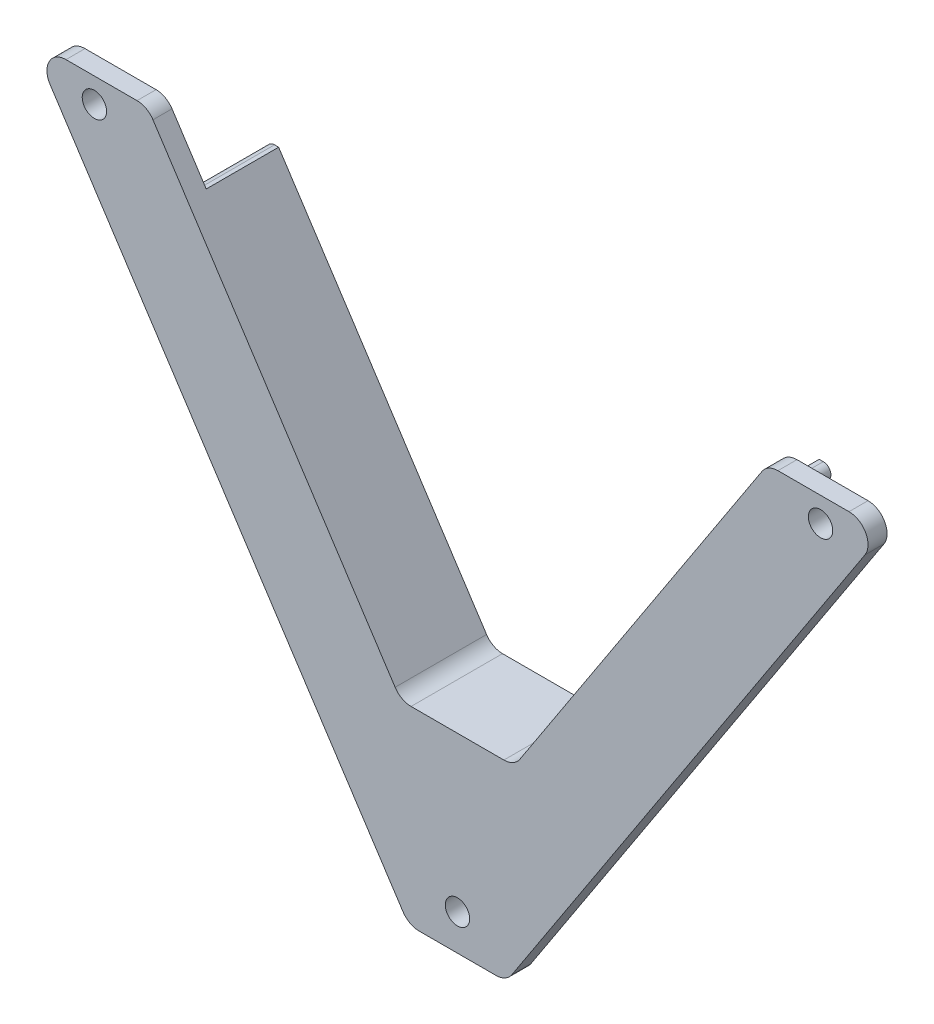
ISO-10303-21;
HEADER;
FILE_DESCRIPTION(('STEP AP214'),'2;1');
FILE_NAME('part.step','',(''),(''),'','','');
FILE_SCHEMA(('AUTOMOTIVE_DESIGN { 1 0 10303 214 1 1 1 1 }'));
ENDSEC;
DATA;
#1=APPLICATION_CONTEXT('core data for automotive mechanical design processes');
#2=APPLICATION_PROTOCOL_DEFINITION('international standard','automotive_design',2000,#1);
#3=PRODUCT_CONTEXT('',#1,'mechanical');
#4=PRODUCT('Part','Part','',(#3));
#5=PRODUCT_RELATED_PRODUCT_CATEGORY('part','',(#4));
#6=PRODUCT_DEFINITION_FORMATION('','',#4);
#7=PRODUCT_DEFINITION_CONTEXT('part definition',#1,'design');
#8=PRODUCT_DEFINITION('design','',#6,#7);
#9=PRODUCT_DEFINITION_SHAPE('','',#8);
#10=(LENGTH_UNIT() NAMED_UNIT(*) SI_UNIT(.MILLI.,.METRE.));
#11=(NAMED_UNIT(*) PLANE_ANGLE_UNIT() SI_UNIT($,.RADIAN.));
#12=(NAMED_UNIT(*) SI_UNIT($,.STERADIAN.) SOLID_ANGLE_UNIT());
#13=UNCERTAINTY_MEASURE_WITH_UNIT(LENGTH_MEASURE(1.E-05),#10,'distance_accuracy_value','');
#14=(GEOMETRIC_REPRESENTATION_CONTEXT(3) GLOBAL_UNCERTAINTY_ASSIGNED_CONTEXT((#13)) GLOBAL_UNIT_ASSIGNED_CONTEXT((#10,
#11,#12)) REPRESENTATION_CONTEXT('',''));
#15=CARTESIAN_POINT('',(0.,0.,0.));
#16=DIRECTION('',(0.,0.,1.));
#17=DIRECTION('',(1.,0.,0.));
#18=AXIS2_PLACEMENT_3D('',#15,#16,#17);
#19=CARTESIAN_POINT('',(0.,0.,0.));
#20=DIRECTION('',(0.,0.,1.));
#21=DIRECTION('',(1.,0.,0.));
#22=AXIS2_PLACEMENT_3D('',#19,#20,#21);
#23=PLANE('',#22);
#24=CARTESIAN_POINT('',(47.6470734615709,72.6442800981008,0.));
#25=DIRECTION('',(0.,0.,1.));
#26=DIRECTION('',(1.,0.,0.));
#27=AXIS2_PLACEMENT_3D('',#24,#25,#26);
#28=CIRCLE('',#27,1.6);
#29=CARTESIAN_POINT('',(49.2470734615709,72.6442800981008,0.));
#30=VERTEX_POINT('',#29);
#31=EDGE_CURVE('E241',#30,#30,#28,.T.);
#32=ORIENTED_EDGE('',*,*,#31,.T.);
#33=EDGE_LOOP('',(#32));
#34=FACE_BOUND('',#33,.T.);
#35=CARTESIAN_POINT('',(-47.6470734615709,72.6442800981008,0.));
#36=DIRECTION('',(0.,0.,1.));
#37=DIRECTION('',(1.,0.,0.));
#38=AXIS2_PLACEMENT_3D('',#35,#36,#37);
#39=CIRCLE('',#38,1.6);
#40=CARTESIAN_POINT('',(-46.0470734615709,72.6442800981008,0.));
#41=VERTEX_POINT('',#40);
#42=EDGE_CURVE('E546',#41,#41,#39,.T.);
#43=ORIENTED_EDGE('',*,*,#42,.T.);
#44=EDGE_LOOP('',(#43));
#45=FACE_BOUND('',#44,.T.);
#46=CARTESIAN_POINT('',(0.,4.7,0.));
#47=DIRECTION('',(0.,0.,1.));
#48=DIRECTION('',(1.,0.,0.));
#49=AXIS2_PLACEMENT_3D('',#46,#47,#48);
#50=CIRCLE('',#49,1.6);
#51=CARTESIAN_POINT('',(1.6,4.7,0.));
#52=VERTEX_POINT('',#51);
#53=EDGE_CURVE('E257',#52,#52,#50,.T.);
#54=ORIENTED_EDGE('',*,*,#53,.T.);
#55=EDGE_LOOP('',(#54));
#56=FACE_BOUND('',#55,.T.);
#57=DIRECTION('',(0.547192886455696,0.837006538213582,0.));
#58=VECTOR('',#57,1.);
#59=CARTESIAN_POINT('',(-6.23516151060933,4.07623581028368,0.));
#60=LINE('',#59,#58);
#61=CARTESIAN_POINT('',(35.470001318044,67.87,0.));
#62=VERTEX_POINT('',#61);
#63=CARTESIAN_POINT('',(39.9599435603072,74.7379822161393,0.));
#64=VERTEX_POINT('',#63);
#65=EDGE_CURVE('E290',#62,#64,#60,.T.);
#66=ORIENTED_EDGE('',*,*,#65,.T.);
#67=CARTESIAN_POINT('',(42.0524599058411,73.37,0.));
#68=DIRECTION('',(0.,0.,1.));
#69=DIRECTION('',(1.,0.,0.));
#70=AXIS2_PLACEMENT_3D('',#67,#68,#69);
#71=CIRCLE('',#70,2.5);
#72=CARTESIAN_POINT('',(42.0524599058411,75.87,0.));
#73=VERTEX_POINT('',#72);
#74=EDGE_CURVE('E345',#64,#73,#71,.F.);
#75=ORIENTED_EDGE('',*,*,#74,.T.);
#76=DIRECTION('',(1.,0.,0.));
#77=VECTOR('',#76,1.);
#78=CARTESIAN_POINT('',(0.,75.87,0.));
#79=LINE('',#78,#77);
#80=CARTESIAN_POINT('',(51.3787909179364,75.87,0.));
#81=VERTEX_POINT('',#80);
#82=EDGE_CURVE('E260',#73,#81,#79,.T.);
#83=ORIENTED_EDGE('',*,*,#82,.T.);
#84=CARTESIAN_POINT('',(51.3787909179364,73.37,0.));
#85=DIRECTION('',(0.,0.,1.));
#86=DIRECTION('',(1.,0.,0.));
#87=AXIS2_PLACEMENT_3D('',#84,#85,#86);
#88=CIRCLE('',#87,2.5);
#89=CARTESIAN_POINT('',(53.4713072634703,72.0020177838608,0.));
#90=VERTEX_POINT('',#89);
#91=EDGE_CURVE('E343',#81,#90,#88,.F.);
#92=ORIENTED_EDGE('',*,*,#91,.T.);
#93=DIRECTION('',(0.547192886455696,0.837006538213582,0.));
#94=VECTOR('',#93,1.);
#95=CARTESIAN_POINT('',(4.48371164807862,-2.93122575121523,0.));
#96=LINE('',#95,#94);
#97=CARTESIAN_POINT('',(7.14005643969281,1.13201778386076,0.));
#98=VERTEX_POINT('',#97);
#99=EDGE_CURVE('E267',#98,#90,#96,.T.);
#100=ORIENTED_EDGE('',*,*,#99,.F.);
#101=CARTESIAN_POINT('',(5.04754009415886,2.5,0.));
#102=DIRECTION('',(0.,0.,1.));
#103=DIRECTION('',(1.,0.,0.));
#104=AXIS2_PLACEMENT_3D('',#101,#102,#103);
#105=CIRCLE('',#104,2.5);
#106=CARTESIAN_POINT('',(5.04754009415886,0.,0.));
#107=VERTEX_POINT('',#106);
#108=EDGE_CURVE('E337',#98,#107,#105,.F.);
#109=ORIENTED_EDGE('',*,*,#108,.T.);
#110=DIRECTION('',(-1.,0.,0.));
#111=VECTOR('',#110,1.);
#112=CARTESIAN_POINT('',(0.,0.,0.));
#113=LINE('',#112,#111);
#114=CARTESIAN_POINT('',(-5.04754009415886,0.,0.));
#115=VERTEX_POINT('',#114);
#116=EDGE_CURVE('E301',#107,#115,#113,.T.);
#117=ORIENTED_EDGE('',*,*,#116,.T.);
#118=CARTESIAN_POINT('',(-5.04754009415886,2.5,0.));
#119=DIRECTION('',(0.,0.,1.));
#120=DIRECTION('',(1.,0.,0.));
#121=AXIS2_PLACEMENT_3D('',#118,#119,#120);
#122=CIRCLE('',#121,2.5);
#123=CARTESIAN_POINT('',(-7.14005643969281,1.13201778386076,0.));
#124=VERTEX_POINT('',#123);
#125=EDGE_CURVE('E335',#115,#124,#122,.F.);
#126=ORIENTED_EDGE('',*,*,#125,.T.);
#127=DIRECTION('',(-0.547192886455696,0.837006538213582,0.));
#128=VECTOR('',#127,1.);
#129=CARTESIAN_POINT('',(-4.48371164807862,-2.93122575121523,0.));
#130=LINE('',#129,#128);
#131=CARTESIAN_POINT('',(-53.4713072634703,72.0020177838608,0.));
#132=VERTEX_POINT('',#131);
#133=EDGE_CURVE('E298',#124,#132,#130,.T.);
#134=ORIENTED_EDGE('',*,*,#133,.T.);
#135=CARTESIAN_POINT('',(-51.3787909179364,73.37,0.));
#136=DIRECTION('',(0.,0.,1.));
#137=DIRECTION('',(1.,0.,0.));
#138=AXIS2_PLACEMENT_3D('',#135,#136,#137);
#139=CIRCLE('',#138,2.5);
#140=CARTESIAN_POINT('',(-51.3787909179364,75.87,0.));
#141=VERTEX_POINT('',#140);
#142=EDGE_CURVE('E339',#132,#141,#139,.F.);
#143=ORIENTED_EDGE('',*,*,#142,.T.);
#144=DIRECTION('',(1.,0.,0.));
#145=VECTOR('',#144,1.);
#146=CARTESIAN_POINT('',(0.,75.87,0.));
#147=LINE('',#146,#145);
#148=CARTESIAN_POINT('',(-42.0524599058412,75.87,0.));
#149=VERTEX_POINT('',#148);
#150=EDGE_CURVE('E295',#141,#149,#147,.T.);
#151=ORIENTED_EDGE('',*,*,#150,.T.);
#152=CARTESIAN_POINT('',(-42.0524599058412,73.37,0.));
#153=DIRECTION('',(0.,0.,1.));
#154=DIRECTION('',(1.,0.,0.));
#155=AXIS2_PLACEMENT_3D('',#152,#153,#154);
#156=CIRCLE('',#155,2.5);
#157=CARTESIAN_POINT('',(-39.9599435603072,74.7379822161393,0.));
#158=VERTEX_POINT('',#157);
#159=EDGE_CURVE('E341',#149,#158,#156,.F.);
#160=ORIENTED_EDGE('',*,*,#159,.T.);
#161=DIRECTION('',(0.547192886455696,-0.837006538213582,0.));
#162=VECTOR('',#161,1.);
#163=CARTESIAN_POINT('',(6.23516151060934,4.07623581028369,0.));
#164=LINE('',#163,#162);
#165=CARTESIAN_POINT('',(-35.4700013180441,67.87,0.));
#166=VERTEX_POINT('',#165);
#167=EDGE_CURVE('E293',#158,#166,#164,.T.);
#168=ORIENTED_EDGE('',*,*,#167,.T.);
#169=DIRECTION('',(1.,0.,0.));
#170=VECTOR('',#169,1.);
#171=CARTESIAN_POINT('',(-35.470001318044,67.87,0.));
#172=LINE('',#171,#170);
#173=CARTESIAN_POINT('',(-36.0109852803805,67.87,0.));
#174=VERTEX_POINT('',#173);
#175=EDGE_CURVE('E248',#174,#166,#172,.T.);
#176=ORIENTED_EDGE('',*,*,#175,.F.);
#177=CARTESIAN_POINT('',(-36.0109852803805,66.87,0.));
#178=DIRECTION('',(0.,0.,1.));
#179=DIRECTION('',(1.,0.,0.));
#180=AXIS2_PLACEMENT_3D('',#177,#178,#179);
#181=CIRCLE('',#180,1.);
#182=CARTESIAN_POINT('',(-36.8479918185941,66.3228071135443,0.));
#183=VERTEX_POINT('',#182);
#184=EDGE_CURVE('E316',#174,#183,#181,.T.);
#185=ORIENTED_EDGE('',*,*,#184,.T.);
#186=DIRECTION('',(-0.547192886455696,0.837006538213582,0.));
#187=VECTOR('',#186,1.);
#188=CARTESIAN_POINT('',(-37.8594689132059,67.87,0.));
#189=LINE('',#188,#187);
#190=CARTESIAN_POINT('',(-8.52571380578532,23.,0.));
#191=VERTEX_POINT('',#190);
#192=EDGE_CURVE('E245',#191,#183,#189,.T.);
#193=ORIENTED_EDGE('',*,*,#192,.F.);
#194=DIRECTION('',(-1.,0.,0.));
#195=VECTOR('',#194,1.);
#196=CARTESIAN_POINT('',(-8.52571380578532,23.,0.));
#197=LINE('',#196,#195);
#198=CARTESIAN_POINT('',(8.52571380578532,23.,0.));
#199=VERTEX_POINT('',#198);
#200=EDGE_CURVE('E243',#199,#191,#197,.T.);
#201=ORIENTED_EDGE('',*,*,#200,.F.);
#202=DIRECTION('',(-0.547192886455696,-0.837006538213582,0.));
#203=VECTOR('',#202,1.);
#204=CARTESIAN_POINT('',(8.52571380578532,23.,0.));
#205=LINE('',#204,#203);
#206=CARTESIAN_POINT('',(36.8479918185941,66.3228071135443,0.));
#207=VERTEX_POINT('',#206);
#208=EDGE_CURVE('E212',#207,#199,#205,.T.);
#209=ORIENTED_EDGE('',*,*,#208,.F.);
#210=CARTESIAN_POINT('',(36.0109852803805,66.87,0.));
#211=DIRECTION('',(0.,0.,1.));
#212=DIRECTION('',(1.,0.,0.));
#213=AXIS2_PLACEMENT_3D('',#210,#211,#212);
#214=CIRCLE('',#213,1.);
#215=CARTESIAN_POINT('',(36.0109852803805,67.87,0.));
#216=VERTEX_POINT('',#215);
#217=EDGE_CURVE('E318',#207,#216,#214,.T.);
#218=ORIENTED_EDGE('',*,*,#217,.T.);
#219=DIRECTION('',(1.,0.,0.));
#220=VECTOR('',#219,1.);
#221=CARTESIAN_POINT('',(37.8594689132059,67.87,0.));
#222=LINE('',#221,#220);
#223=EDGE_CURVE('E238',#62,#216,#222,.T.);
#224=ORIENTED_EDGE('',*,*,#223,.F.);
#225=EDGE_LOOP('',(#66,#75,#83,#92,#100,#109,#117,#126,#134,#143,#151,#160,#168,#176,#185,#193,
#201,#209,#218,#224));
#226=FACE_BOUND('',#225,.T.);
#227=ADVANCED_FACE('F32',(#34,#45,#56,#226),#23,.F.);
#228=CARTESIAN_POINT('',(0.,75.87,2.5));
#229=DIRECTION('',(0.,1.,0.));
#230=DIRECTION('',(0.,0.,1.));
#231=AXIS2_PLACEMENT_3D('',#228,#229,#230);
#232=PLANE('',#231);
#233=ORIENTED_EDGE('',*,*,#82,.F.);
#234=DIRECTION('',(0.,0.,-1.));
#235=VECTOR('',#234,1.);
#236=CARTESIAN_POINT('',(42.0524599058411,75.87,2.5));
#237=LINE('',#236,#235);
#238=CARTESIAN_POINT('',(42.0524599058411,75.87,2.5));
#239=VERTEX_POINT('',#238);
#240=EDGE_CURVE('E350',#73,#239,#237,.F.);
#241=ORIENTED_EDGE('',*,*,#240,.T.);
#242=DIRECTION('',(1.,0.,0.));
#243=VECTOR('',#242,1.);
#244=CARTESIAN_POINT('',(0.,75.87,2.5));
#245=LINE('',#244,#243);
#246=CARTESIAN_POINT('',(51.3787909179364,75.87,2.5));
#247=VERTEX_POINT('',#246);
#248=EDGE_CURVE('E263',#239,#247,#245,.T.);
#249=ORIENTED_EDGE('',*,*,#248,.T.);
#250=DIRECTION('',(0.,0.,-1.));
#251=VECTOR('',#250,1.);
#252=CARTESIAN_POINT('',(51.3787909179364,75.87,0.));
#253=LINE('',#252,#251);
#254=EDGE_CURVE('E347',#247,#81,#253,.T.);
#255=ORIENTED_EDGE('',*,*,#254,.T.);
#256=EDGE_LOOP('',(#233,#241,#249,#255));
#257=FACE_BOUND('',#256,.T.);
#258=ADVANCED_FACE('F451',(#257),#232,.T.);
#259=CARTESIAN_POINT('',(-6.23516151060933,4.07623581028368,2.5));
#260=DIRECTION('',(-0.837006538213582,0.547192886455696,0.));
#261=DIRECTION('',(-0.547192886455696,-0.837006538213582,0.));
#262=AXIS2_PLACEMENT_3D('',#259,#260,#261);
#263=PLANE('',#262);
#264=DIRECTION('',(0.547192886455696,0.837006538213582,0.));
#265=VECTOR('',#264,1.);
#266=CARTESIAN_POINT('',(35.470001318044,67.87,-9.5));
#267=LINE('',#266,#265);
#268=CARTESIAN_POINT('',(8.18380232080522,26.1320177838608,-9.5));
#269=VERTEX_POINT('',#268);
#270=CARTESIAN_POINT('',(35.470001318044,67.87,-9.5));
#271=VERTEX_POINT('',#270);
#272=EDGE_CURVE('E235',#269,#271,#267,.T.);
#273=ORIENTED_EDGE('',*,*,#272,.F.);
#274=DIRECTION('',(0.,0.,-1.));
#275=VECTOR('',#274,1.);
#276=CARTESIAN_POINT('',(8.18380232080523,26.1320177838608,2.5));
#277=LINE('',#276,#275);
#278=CARTESIAN_POINT('',(8.18380232080524,26.1320177838608,2.5));
#279=VERTEX_POINT('',#278);
#280=EDGE_CURVE('E333',#269,#279,#277,.F.);
#281=ORIENTED_EDGE('',*,*,#280,.T.);
#282=DIRECTION('',(0.547192886455696,0.837006538213582,0.));
#283=VECTOR('',#282,1.);
#284=CARTESIAN_POINT('',(-6.23516151060933,4.07623581028368,2.5));
#285=LINE('',#284,#283);
#286=CARTESIAN_POINT('',(39.9599435603072,74.7379822161393,2.5));
#287=VERTEX_POINT('',#286);
#288=EDGE_CURVE('E266',#279,#287,#285,.T.);
#289=ORIENTED_EDGE('',*,*,#288,.T.);
#290=DIRECTION('',(0.,0.,-1.));
#291=VECTOR('',#290,1.);
#292=CARTESIAN_POINT('',(39.9599435603072,74.7379822161392,2.5));
#293=LINE('',#292,#291);
#294=EDGE_CURVE('E330',#287,#64,#293,.T.);
#295=ORIENTED_EDGE('',*,*,#294,.T.);
#296=ORIENTED_EDGE('',*,*,#65,.F.);
#297=DIRECTION('',(0.,0.,1.));
#298=VECTOR('',#297,1.);
#299=CARTESIAN_POINT('',(35.470001318044,67.87,-9.5));
#300=LINE('',#299,#298);
#301=EDGE_CURVE('E237',#271,#62,#300,.T.);
#302=ORIENTED_EDGE('',*,*,#301,.F.);
#303=EDGE_LOOP('',(#273,#281,#289,#295,#296,#302));
#304=FACE_BOUND('',#303,.T.);
#305=ADVANCED_FACE('F392',(#304),#263,.T.);
#306=CARTESIAN_POINT('',(0.,25.,2.5));
#307=DIRECTION('',(0.,1.,0.));
#308=DIRECTION('',(-1.,0.,0.));
#309=AXIS2_PLACEMENT_3D('',#306,#307,#308);
#310=PLANE('',#309);
#311=DIRECTION('',(1.,0.,0.));
#312=VECTOR('',#311,1.);
#313=CARTESIAN_POINT('',(7.44374588111242,25.,-9.5));
#314=LINE('',#313,#312);
#315=CARTESIAN_POINT('',(-6.09128597527128,25.,-9.5));
#316=VERTEX_POINT('',#315);
#317=CARTESIAN_POINT('',(6.09128597527128,25.,-9.5));
#318=VERTEX_POINT('',#317);
#319=EDGE_CURVE('E232',#316,#318,#314,.T.);
#320=ORIENTED_EDGE('',*,*,#319,.F.);
#321=DIRECTION('',(0.,0.,-1.));
#322=VECTOR('',#321,1.);
#323=CARTESIAN_POINT('',(-6.09128597527128,25.,2.5));
#324=LINE('',#323,#322);
#325=CARTESIAN_POINT('',(-6.09128597527128,25.,2.5));
#326=VERTEX_POINT('',#325);
#327=EDGE_CURVE('E328',#316,#326,#324,.F.);
#328=ORIENTED_EDGE('',*,*,#327,.T.);
#329=DIRECTION('',(1.,0.,0.));
#330=VECTOR('',#329,1.);
#331=CARTESIAN_POINT('',(0.,25.,2.5));
#332=LINE('',#331,#330);
#333=CARTESIAN_POINT('',(6.09128597527128,25.,2.5));
#334=VERTEX_POINT('',#333);
#335=EDGE_CURVE('E270',#326,#334,#332,.T.);
#336=ORIENTED_EDGE('',*,*,#335,.T.);
#337=DIRECTION('',(0.,0.,-1.));
#338=VECTOR('',#337,1.);
#339=CARTESIAN_POINT('',(6.09128597527128,25.,-9.5));
#340=LINE('',#339,#338);
#341=EDGE_CURVE('E325',#334,#318,#340,.T.);
#342=ORIENTED_EDGE('',*,*,#341,.T.);
#343=EDGE_LOOP('',(#320,#328,#336,#342));
#344=FACE_BOUND('',#343,.T.);
#345=ADVANCED_FACE('F403',(#344),#310,.T.);
#346=CARTESIAN_POINT('',(6.23516151060934,4.07623581028369,2.5));
#347=DIRECTION('',(0.837006538213581,0.547192886455696,0.));
#348=DIRECTION('',(-0.547192886455696,0.837006538213582,0.));
#349=AXIS2_PLACEMENT_3D('',#346,#347,#348);
#350=PLANE('',#349);
#351=DIRECTION('',(0.547192886455696,-0.837006538213582,0.));
#352=VECTOR('',#351,1.);
#353=CARTESIAN_POINT('',(6.23516151060934,4.07623581028369,2.5));
#354=LINE('',#353,#352);
#355=CARTESIAN_POINT('',(-39.9599435603072,74.7379822161393,2.5));
#356=VERTEX_POINT('',#355);
#357=CARTESIAN_POINT('',(-8.18380232080525,26.1320177838608,2.5));
#358=VERTEX_POINT('',#357);
#359=EDGE_CURVE('E273',#356,#358,#354,.T.);
#360=ORIENTED_EDGE('',*,*,#359,.T.);
#361=DIRECTION('',(0.,0.,-1.));
#362=VECTOR('',#361,1.);
#363=CARTESIAN_POINT('',(-8.18380232080523,26.1320177838608,-9.5));
#364=LINE('',#363,#362);
#365=CARTESIAN_POINT('',(-8.18380232080524,26.1320177838608,-9.5));
#366=VERTEX_POINT('',#365);
#367=EDGE_CURVE('E322',#358,#366,#364,.T.);
#368=ORIENTED_EDGE('',*,*,#367,.T.);
#369=DIRECTION('',(0.547192886455695,-0.837006538213582,0.));
#370=VECTOR('',#369,1.);
#371=CARTESIAN_POINT('',(-7.44374588111243,25.,-9.5));
#372=LINE('',#371,#370);
#373=CARTESIAN_POINT('',(-35.470001318044,67.87,-9.5));
#374=VERTEX_POINT('',#373);
#375=EDGE_CURVE('E229',#374,#366,#372,.T.);
#376=ORIENTED_EDGE('',*,*,#375,.F.);
#377=DIRECTION('',(0.,0.,1.));
#378=VECTOR('',#377,1.);
#379=CARTESIAN_POINT('',(-35.470001318044,67.87,-9.5));
#380=LINE('',#379,#378);
#381=EDGE_CURVE('E253',#374,#166,#380,.T.);
#382=ORIENTED_EDGE('',*,*,#381,.T.);
#383=ORIENTED_EDGE('',*,*,#167,.F.);
#384=DIRECTION('',(0.,0.,-1.));
#385=VECTOR('',#384,1.);
#386=CARTESIAN_POINT('',(-39.9599435603072,74.7379822161392,2.5));
#387=LINE('',#386,#385);
#388=EDGE_CURVE('E320',#158,#356,#387,.F.);
#389=ORIENTED_EDGE('',*,*,#388,.T.);
#390=EDGE_LOOP('',(#360,#368,#376,#382,#383,#389));
#391=FACE_BOUND('',#390,.T.);
#392=ADVANCED_FACE('F411',(#391),#350,.T.);
#393=CARTESIAN_POINT('',(0.,75.87,2.5));
#394=DIRECTION('',(0.,1.,0.));
#395=DIRECTION('',(0.,0.,1.));
#396=AXIS2_PLACEMENT_3D('',#393,#394,#395);
#397=PLANE('',#396);
#398=DIRECTION('',(1.,0.,0.));
#399=VECTOR('',#398,1.);
#400=CARTESIAN_POINT('',(0.,75.87,2.5));
#401=LINE('',#400,#399);
#402=CARTESIAN_POINT('',(-51.3787909179364,75.87,2.5));
#403=VERTEX_POINT('',#402);
#404=CARTESIAN_POINT('',(-42.0524599058412,75.87,2.5));
#405=VERTEX_POINT('',#404);
#406=EDGE_CURVE('E276',#403,#405,#401,.T.);
#407=ORIENTED_EDGE('',*,*,#406,.T.);
#408=DIRECTION('',(0.,0.,-1.));
#409=VECTOR('',#408,1.);
#410=CARTESIAN_POINT('',(-42.0524599058412,75.87,2.5));
#411=LINE('',#410,#409);
#412=EDGE_CURVE('E369',#405,#149,#411,.T.);
#413=ORIENTED_EDGE('',*,*,#412,.T.);
#414=ORIENTED_EDGE('',*,*,#150,.F.);
#415=DIRECTION('',(0.,0.,-1.));
#416=VECTOR('',#415,1.);
#417=CARTESIAN_POINT('',(-51.3787909179364,75.87,2.5));
#418=LINE('',#417,#416);
#419=EDGE_CURVE('E367',#141,#403,#418,.F.);
#420=ORIENTED_EDGE('',*,*,#419,.T.);
#421=EDGE_LOOP('',(#407,#413,#414,#420));
#422=FACE_BOUND('',#421,.T.);
#423=ADVANCED_FACE('F421',(#422),#397,.T.);
#424=CARTESIAN_POINT('',(-4.48371164807862,-2.93122575121523,2.5));
#425=DIRECTION('',(-0.837006538213582,-0.547192886455696,0.));
#426=DIRECTION('',(0.547192886455696,-0.837006538213582,0.));
#427=AXIS2_PLACEMENT_3D('',#424,#425,#426);
#428=PLANE('',#427);
#429=DIRECTION('',(-0.547192886455696,0.837006538213582,0.));
#430=VECTOR('',#429,1.);
#431=CARTESIAN_POINT('',(-4.48371164807862,-2.93122575121523,2.5));
#432=LINE('',#431,#430);
#433=CARTESIAN_POINT('',(-7.14005643969281,1.13201778386076,2.5));
#434=VERTEX_POINT('',#433);
#435=CARTESIAN_POINT('',(-53.4713072634703,72.0020177838608,2.5));
#436=VERTEX_POINT('',#435);
#437=EDGE_CURVE('E279',#434,#436,#432,.T.);
#438=ORIENTED_EDGE('',*,*,#437,.T.);
#439=DIRECTION('',(0.,0.,-1.));
#440=VECTOR('',#439,1.);
#441=CARTESIAN_POINT('',(-53.4713072634704,72.0020177838608,2.5));
#442=LINE('',#441,#440);
#443=EDGE_CURVE('E374',#436,#132,#442,.T.);
#444=ORIENTED_EDGE('',*,*,#443,.T.);
#445=ORIENTED_EDGE('',*,*,#133,.F.);
#446=DIRECTION('',(0.,0.,-1.));
#447=VECTOR('',#446,1.);
#448=CARTESIAN_POINT('',(-7.14005643969281,1.13201778386076,2.5));
#449=LINE('',#448,#447);
#450=EDGE_CURVE('E372',#124,#434,#449,.F.);
#451=ORIENTED_EDGE('',*,*,#450,.T.);
#452=EDGE_LOOP('',(#438,#444,#445,#451));
#453=FACE_BOUND('',#452,.T.);
#454=ADVANCED_FACE('F430',(#453),#428,.T.);
#455=CARTESIAN_POINT('',(0.,0.,2.5));
#456=DIRECTION('',(0.,-1.,0.));
#457=DIRECTION('',(1.,0.,0.));
#458=AXIS2_PLACEMENT_3D('',#455,#456,#457);
#459=PLANE('',#458);
#460=ORIENTED_EDGE('',*,*,#116,.F.);
#461=DIRECTION('',(0.,0.,-1.));
#462=VECTOR('',#461,1.);
#463=CARTESIAN_POINT('',(5.04754009415886,0.,2.5));
#464=LINE('',#463,#462);
#465=CARTESIAN_POINT('',(5.04754009415886,0.,2.5));
#466=VERTEX_POINT('',#465);
#467=EDGE_CURVE('E380',#107,#466,#464,.F.);
#468=ORIENTED_EDGE('',*,*,#467,.T.);
#469=DIRECTION('',(-1.,0.,0.));
#470=VECTOR('',#469,1.);
#471=CARTESIAN_POINT('',(0.,0.,2.5));
#472=LINE('',#471,#470);
#473=CARTESIAN_POINT('',(-5.04754009415886,0.,2.5));
#474=VERTEX_POINT('',#473);
#475=EDGE_CURVE('E282',#466,#474,#472,.T.);
#476=ORIENTED_EDGE('',*,*,#475,.T.);
#477=DIRECTION('',(0.,0.,-1.));
#478=VECTOR('',#477,1.);
#479=CARTESIAN_POINT('',(-5.04754009415886,0.,2.5));
#480=LINE('',#479,#478);
#481=EDGE_CURVE('E377',#474,#115,#480,.T.);
#482=ORIENTED_EDGE('',*,*,#481,.T.);
#483=EDGE_LOOP('',(#460,#468,#476,#482));
#484=FACE_BOUND('',#483,.T.);
#485=ADVANCED_FACE('F437',(#484),#459,.T.);
#486=CARTESIAN_POINT('',(4.48371164807862,-2.93122575121523,2.5));
#487=DIRECTION('',(-0.837006538213582,0.547192886455696,0.));
#488=DIRECTION('',(-0.547192886455696,-0.837006538213582,0.));
#489=AXIS2_PLACEMENT_3D('',#486,#487,#488);
#490=PLANE('',#489);
#491=ORIENTED_EDGE('',*,*,#99,.T.);
#492=DIRECTION('',(0.,0.,-1.));
#493=VECTOR('',#492,1.);
#494=CARTESIAN_POINT('',(53.4713072634703,72.0020177838608,2.5));
#495=LINE('',#494,#493);
#496=CARTESIAN_POINT('',(53.4713072634703,72.0020177838608,2.5));
#497=VERTEX_POINT('',#496);
#498=EDGE_CURVE('E47',#90,#497,#495,.F.);
#499=ORIENTED_EDGE('',*,*,#498,.T.);
#500=DIRECTION('',(0.547192886455696,0.837006538213582,0.));
#501=VECTOR('',#500,1.);
#502=CARTESIAN_POINT('',(4.48371164807862,-2.93122575121523,2.5));
#503=LINE('',#502,#501);
#504=CARTESIAN_POINT('',(7.14005643969281,1.13201778386076,2.5));
#505=VERTEX_POINT('',#504);
#506=EDGE_CURVE('E285',#505,#497,#503,.T.);
#507=ORIENTED_EDGE('',*,*,#506,.F.);
#508=DIRECTION('',(0.,0.,-1.));
#509=VECTOR('',#508,1.);
#510=CARTESIAN_POINT('',(7.14005643969281,1.13201778386076,0.));
#511=LINE('',#510,#509);
#512=EDGE_CURVE('E363',#505,#98,#511,.T.);
#513=ORIENTED_EDGE('',*,*,#512,.T.);
#514=EDGE_LOOP('',(#491,#499,#507,#513));
#515=FACE_BOUND('',#514,.T.);
#516=ADVANCED_FACE('F443',(#515),#490,.F.);
#517=CARTESIAN_POINT('',(0.,0.,2.5));
#518=DIRECTION('',(0.,0.,1.));
#519=DIRECTION('',(1.,0.,0.));
#520=AXIS2_PLACEMENT_3D('',#517,#518,#519);
#521=PLANE('',#520);
#522=CARTESIAN_POINT('',(47.6470734615709,72.6442800981008,2.5));
#523=DIRECTION('',(0.,0.,1.));
#524=DIRECTION('',(1.,0.,0.));
#525=AXIS2_PLACEMENT_3D('',#522,#523,#524);
#526=CIRCLE('',#525,1.6);
#527=CARTESIAN_POINT('',(49.2470734615709,72.6442800981008,2.5));
#528=VERTEX_POINT('',#527);
#529=EDGE_CURVE('E547',#528,#528,#526,.T.);
#530=ORIENTED_EDGE('',*,*,#529,.F.);
#531=EDGE_LOOP('',(#530));
#532=FACE_BOUND('',#531,.T.);
#533=CARTESIAN_POINT('',(-47.6470734615709,72.6442800981008,2.5));
#534=DIRECTION('',(0.,0.,1.));
#535=DIRECTION('',(-1.,0.,0.));
#536=AXIS2_PLACEMENT_3D('',#533,#534,#535);
#537=CIRCLE('',#536,1.6);
#538=CARTESIAN_POINT('',(-49.2470734615709,72.6442800981008,2.5));
#539=VERTEX_POINT('',#538);
#540=EDGE_CURVE('E543',#539,#539,#537,.T.);
#541=ORIENTED_EDGE('',*,*,#540,.F.);
#542=EDGE_LOOP('',(#541));
#543=FACE_BOUND('',#542,.T.);
#544=CARTESIAN_POINT('',(0.,4.7,2.5));
#545=DIRECTION('',(0.,0.,1.));
#546=DIRECTION('',(1.,0.,0.));
#547=AXIS2_PLACEMENT_3D('',#544,#545,#546);
#548=CIRCLE('',#547,1.6);
#549=CARTESIAN_POINT('',(1.6,4.7,2.5));
#550=VERTEX_POINT('',#549);
#551=EDGE_CURVE('E216',#550,#550,#548,.T.);
#552=ORIENTED_EDGE('',*,*,#551,.F.);
#553=EDGE_LOOP('',(#552));
#554=FACE_BOUND('',#553,.T.);
#555=ORIENTED_EDGE('',*,*,#248,.F.);
#556=CARTESIAN_POINT('',(42.0524599058411,73.37,2.5));
#557=DIRECTION('',(0.,0.,1.));
#558=DIRECTION('',(1.,0.,0.));
#559=AXIS2_PLACEMENT_3D('',#556,#557,#558);
#560=CIRCLE('',#559,2.5);
#561=EDGE_CURVE('E361',#239,#287,#560,.T.);
#562=ORIENTED_EDGE('',*,*,#561,.T.);
#563=ORIENTED_EDGE('',*,*,#288,.F.);
#564=CARTESIAN_POINT('',(6.09128597527128,27.5,2.5));
#565=DIRECTION('',(0.,0.,1.));
#566=DIRECTION('',(1.,0.,0.));
#567=AXIS2_PLACEMENT_3D('',#564,#565,#566);
#568=CIRCLE('',#567,2.5);
#569=EDGE_CURVE('E11',#279,#334,#568,.F.);
#570=ORIENTED_EDGE('',*,*,#569,.T.);
#571=ORIENTED_EDGE('',*,*,#335,.F.);
#572=CARTESIAN_POINT('',(-6.09128597527128,27.5,2.5));
#573=DIRECTION('',(0.,0.,1.));
#574=DIRECTION('',(1.,0.,0.));
#575=AXIS2_PLACEMENT_3D('',#572,#573,#574);
#576=CIRCLE('',#575,2.5);
#577=EDGE_CURVE('E384',#326,#358,#576,.F.);
#578=ORIENTED_EDGE('',*,*,#577,.T.);
#579=ORIENTED_EDGE('',*,*,#359,.F.);
#580=CARTESIAN_POINT('',(-42.0524599058412,73.37,2.5));
#581=DIRECTION('',(0.,0.,1.));
#582=DIRECTION('',(1.,0.,0.));
#583=AXIS2_PLACEMENT_3D('',#580,#581,#582);
#584=CIRCLE('',#583,2.5);
#585=EDGE_CURVE('E357',#356,#405,#584,.T.);
#586=ORIENTED_EDGE('',*,*,#585,.T.);
#587=ORIENTED_EDGE('',*,*,#406,.F.);
#588=CARTESIAN_POINT('',(-51.3787909179364,73.37,2.5));
#589=DIRECTION('',(0.,0.,1.));
#590=DIRECTION('',(1.,0.,0.));
#591=AXIS2_PLACEMENT_3D('',#588,#589,#590);
#592=CIRCLE('',#591,2.5);
#593=EDGE_CURVE('E355',#403,#436,#592,.T.);
#594=ORIENTED_EDGE('',*,*,#593,.T.);
#595=ORIENTED_EDGE('',*,*,#437,.F.);
#596=CARTESIAN_POINT('',(-5.04754009415886,2.5,2.5));
#597=DIRECTION('',(0.,0.,1.));
#598=DIRECTION('',(1.,0.,0.));
#599=AXIS2_PLACEMENT_3D('',#596,#597,#598);
#600=CIRCLE('',#599,2.5);
#601=EDGE_CURVE('E352',#434,#474,#600,.T.);
#602=ORIENTED_EDGE('',*,*,#601,.T.);
#603=ORIENTED_EDGE('',*,*,#475,.F.);
#604=CARTESIAN_POINT('',(5.04754009415886,2.5,2.5));
#605=DIRECTION('',(0.,0.,1.));
#606=DIRECTION('',(1.,0.,0.));
#607=AXIS2_PLACEMENT_3D('',#604,#605,#606);
#608=CIRCLE('',#607,2.5);
#609=EDGE_CURVE('E54',#466,#505,#608,.T.);
#610=ORIENTED_EDGE('',*,*,#609,.T.);
#611=ORIENTED_EDGE('',*,*,#506,.T.);
#612=CARTESIAN_POINT('',(51.3787909179364,73.37,2.5));
#613=DIRECTION('',(0.,0.,1.));
#614=DIRECTION('',(1.,0.,0.));
#615=AXIS2_PLACEMENT_3D('',#612,#613,#614);
#616=CIRCLE('',#615,2.5);
#617=EDGE_CURVE('E359',#497,#247,#616,.T.);
#618=ORIENTED_EDGE('',*,*,#617,.T.);
#619=EDGE_LOOP('',(#555,#562,#563,#570,#571,#578,#579,#586,#587,#594,#595,#602,#603,#610,#611,#618));
#620=FACE_BOUND('',#619,.T.);
#621=ADVANCED_FACE('F400',(#532,#543,#554,#620),#521,.T.);
#622=CARTESIAN_POINT('',(0.,4.7,0.));
#623=DIRECTION('',(0.,0.,1.));
#624=DIRECTION('',(1.,0.,0.));
#625=AXIS2_PLACEMENT_3D('',#622,#623,#624);
#626=CYLINDRICAL_SURFACE('',#625,1.6);
#627=ORIENTED_EDGE('',*,*,#53,.F.);
#628=EDGE_LOOP('',(#627));
#629=FACE_BOUND('',#628,.T.);
#630=ORIENTED_EDGE('',*,*,#551,.T.);
#631=EDGE_LOOP('',(#630));
#632=FACE_BOUND('',#631,.T.);
#633=ADVANCED_FACE('F557',(#629,#632),#626,.F.);
#634=CARTESIAN_POINT('',(37.8594689132059,67.87,-9.5));
#635=DIRECTION('',(0.,-1.,0.));
#636=DIRECTION('',(0.,0.,-1.));
#637=AXIS2_PLACEMENT_3D('',#634,#635,#636);
#638=PLANE('',#637);
#639=ORIENTED_EDGE('',*,*,#223,.T.);
#640=DIRECTION('',(0.,0.,1.));
#641=VECTOR('',#640,1.);
#642=CARTESIAN_POINT('',(36.0109852803805,67.87,-9.5));
#643=LINE('',#642,#641);
#644=CARTESIAN_POINT('',(36.0109852803805,67.87,-9.5));
#645=VERTEX_POINT('',#644);
#646=EDGE_CURVE('E314',#216,#645,#643,.F.);
#647=ORIENTED_EDGE('',*,*,#646,.T.);
#648=DIRECTION('',(1.,0.,0.));
#649=VECTOR('',#648,1.);
#650=CARTESIAN_POINT('',(37.8594689132059,67.87,-9.5));
#651=LINE('',#650,#649);
#652=EDGE_CURVE('E206',#271,#645,#651,.T.);
#653=ORIENTED_EDGE('',*,*,#652,.F.);
#654=ORIENTED_EDGE('',*,*,#301,.T.);
#655=EDGE_LOOP('',(#639,#647,#653,#654));
#656=FACE_BOUND('',#655,.T.);
#657=ADVANCED_FACE('F459',(#656),#638,.F.);
#658=CARTESIAN_POINT('',(8.52571380578532,23.,-9.5));
#659=DIRECTION('',(-0.837006538213582,0.547192886455696,0.));
#660=DIRECTION('',(-0.547192886455696,-0.837006538213582,0.));
#661=AXIS2_PLACEMENT_3D('',#658,#659,#660);
#662=PLANE('',#661);
#663=DIRECTION('',(-0.547192886455696,-0.837006538213582,0.));
#664=VECTOR('',#663,1.);
#665=CARTESIAN_POINT('',(8.52571380578532,23.,-9.5));
#666=LINE('',#665,#664);
#667=CARTESIAN_POINT('',(36.8479918185941,66.3228071135443,-9.5));
#668=VERTEX_POINT('',#667);
#669=CARTESIAN_POINT('',(8.52571380578532,23.,-9.5));
#670=VERTEX_POINT('',#669);
#671=EDGE_CURVE('E193',#668,#670,#666,.T.);
#672=ORIENTED_EDGE('',*,*,#671,.F.);
#673=DIRECTION('',(0.,0.,1.));
#674=VECTOR('',#673,1.);
#675=CARTESIAN_POINT('',(36.8479918185941,66.3228071135443,-9.5));
#676=LINE('',#675,#674);
#677=EDGE_CURVE('E312',#668,#207,#676,.T.);
#678=ORIENTED_EDGE('',*,*,#677,.T.);
#679=ORIENTED_EDGE('',*,*,#208,.T.);
#680=DIRECTION('',(0.,0.,1.));
#681=VECTOR('',#680,1.);
#682=CARTESIAN_POINT('',(8.52571380578532,23.,-9.5));
#683=LINE('',#682,#681);
#684=EDGE_CURVE('E209',#670,#199,#683,.T.);
#685=ORIENTED_EDGE('',*,*,#684,.F.);
#686=EDGE_LOOP('',(#672,#678,#679,#685));
#687=FACE_BOUND('',#686,.T.);
#688=ADVANCED_FACE('F210',(#687),#662,.F.);
#689=CARTESIAN_POINT('',(-8.52571380578532,23.,-9.5));
#690=DIRECTION('',(0.,1.,0.));
#691=DIRECTION('',(-1.,0.,0.));
#692=AXIS2_PLACEMENT_3D('',#689,#690,#691);
#693=PLANE('',#692);
#694=ORIENTED_EDGE('',*,*,#200,.T.);
#695=DIRECTION('',(0.,0.,1.));
#696=VECTOR('',#695,1.);
#697=CARTESIAN_POINT('',(-8.52571380578532,23.,-9.5));
#698=LINE('',#697,#696);
#699=CARTESIAN_POINT('',(-8.52571380578532,23.,-9.5));
#700=VERTEX_POINT('',#699);
#701=EDGE_CURVE('E217',#700,#191,#698,.T.);
#702=ORIENTED_EDGE('',*,*,#701,.F.);
#703=DIRECTION('',(-1.,0.,0.));
#704=VECTOR('',#703,1.);
#705=CARTESIAN_POINT('',(-8.52571380578532,23.,-9.5));
#706=LINE('',#705,#704);
#707=EDGE_CURVE('E198',#670,#700,#706,.T.);
#708=ORIENTED_EDGE('',*,*,#707,.F.);
#709=ORIENTED_EDGE('',*,*,#684,.T.);
#710=EDGE_LOOP('',(#694,#702,#708,#709));
#711=FACE_BOUND('',#710,.T.);
#712=ADVANCED_FACE('F219',(#711),#693,.F.);
#713=CARTESIAN_POINT('',(-37.8594689132059,67.87,-9.5));
#714=DIRECTION('',(0.837006538213582,0.547192886455696,0.));
#715=DIRECTION('',(-0.547192886455696,0.837006538213582,0.));
#716=AXIS2_PLACEMENT_3D('',#713,#714,#715);
#717=PLANE('',#716);
#718=ORIENTED_EDGE('',*,*,#192,.T.);
#719=DIRECTION('',(0.,0.,1.));
#720=VECTOR('',#719,1.);
#721=CARTESIAN_POINT('',(-36.8479918185941,66.3228071135443,-9.5));
#722=LINE('',#721,#720);
#723=CARTESIAN_POINT('',(-36.8479918185941,66.3228071135443,-9.5));
#724=VERTEX_POINT('',#723);
#725=EDGE_CURVE('E307',#183,#724,#722,.F.);
#726=ORIENTED_EDGE('',*,*,#725,.T.);
#727=DIRECTION('',(-0.547192886455696,0.837006538213582,0.));
#728=VECTOR('',#727,1.);
#729=CARTESIAN_POINT('',(-37.8594689132059,67.87,-9.5));
#730=LINE('',#729,#728);
#731=EDGE_CURVE('E222',#700,#724,#730,.T.);
#732=ORIENTED_EDGE('',*,*,#731,.F.);
#733=ORIENTED_EDGE('',*,*,#701,.T.);
#734=EDGE_LOOP('',(#718,#726,#732,#733));
#735=FACE_BOUND('',#734,.T.);
#736=ADVANCED_FACE('F463',(#735),#717,.F.);
#737=CARTESIAN_POINT('',(-35.470001318044,67.87,-9.5));
#738=DIRECTION('',(0.,-1.,0.));
#739=DIRECTION('',(0.,0.,-1.));
#740=AXIS2_PLACEMENT_3D('',#737,#738,#739);
#741=PLANE('',#740);
#742=DIRECTION('',(1.,0.,0.));
#743=VECTOR('',#742,1.);
#744=CARTESIAN_POINT('',(-35.470001318044,67.87,-9.5));
#745=LINE('',#744,#743);
#746=CARTESIAN_POINT('',(-36.0109852803805,67.87,-9.5));
#747=VERTEX_POINT('',#746);
#748=EDGE_CURVE('E224',#747,#374,#745,.T.);
#749=ORIENTED_EDGE('',*,*,#748,.F.);
#750=DIRECTION('',(0.,0.,1.));
#751=VECTOR('',#750,1.);
#752=CARTESIAN_POINT('',(-36.0109852803805,67.87,-9.5));
#753=LINE('',#752,#751);
#754=EDGE_CURVE('E287',#747,#174,#753,.T.);
#755=ORIENTED_EDGE('',*,*,#754,.T.);
#756=ORIENTED_EDGE('',*,*,#175,.T.);
#757=ORIENTED_EDGE('',*,*,#381,.F.);
#758=EDGE_LOOP('',(#749,#755,#756,#757));
#759=FACE_BOUND('',#758,.T.);
#760=ADVANCED_FACE('F472',(#759),#741,.F.);
#761=CARTESIAN_POINT('',(0.,0.,-9.5));
#762=DIRECTION('',(0.,0.,1.));
#763=DIRECTION('',(1.,0.,0.));
#764=AXIS2_PLACEMENT_3D('',#761,#762,#763);
#765=PLANE('',#764);
#766=ORIENTED_EDGE('',*,*,#731,.T.);
#767=CARTESIAN_POINT('',(-36.0109852803805,66.87,-9.5));
#768=DIRECTION('',(0.,0.,1.));
#769=DIRECTION('',(1.,0.,0.));
#770=AXIS2_PLACEMENT_3D('',#767,#768,#769);
#771=CIRCLE('',#770,1.);
#772=EDGE_CURVE('E310',#724,#747,#771,.F.);
#773=ORIENTED_EDGE('',*,*,#772,.T.);
#774=ORIENTED_EDGE('',*,*,#748,.T.);
#775=ORIENTED_EDGE('',*,*,#375,.T.);
#776=CARTESIAN_POINT('',(-6.09128597527128,27.5,-9.5));
#777=DIRECTION('',(0.,0.,1.));
#778=DIRECTION('',(1.,0.,0.));
#779=AXIS2_PLACEMENT_3D('',#776,#777,#778);
#780=CIRCLE('',#779,2.5);
#781=EDGE_CURVE('E382',#366,#316,#780,.T.);
#782=ORIENTED_EDGE('',*,*,#781,.T.);
#783=ORIENTED_EDGE('',*,*,#319,.T.);
#784=CARTESIAN_POINT('',(6.09128597527128,27.5,-9.5));
#785=DIRECTION('',(0.,0.,1.));
#786=DIRECTION('',(1.,0.,0.));
#787=AXIS2_PLACEMENT_3D('',#784,#785,#786);
#788=CIRCLE('',#787,2.5);
#789=EDGE_CURVE('E40',#318,#269,#788,.T.);
#790=ORIENTED_EDGE('',*,*,#789,.T.);
#791=ORIENTED_EDGE('',*,*,#272,.T.);
#792=ORIENTED_EDGE('',*,*,#652,.T.);
#793=CARTESIAN_POINT('',(36.0109852803805,66.87,-9.5));
#794=DIRECTION('',(0.,0.,1.));
#795=DIRECTION('',(1.,0.,0.));
#796=AXIS2_PLACEMENT_3D('',#793,#794,#795);
#797=CIRCLE('',#796,1.);
#798=EDGE_CURVE('E202',#645,#668,#797,.F.);
#799=ORIENTED_EDGE('',*,*,#798,.T.);
#800=ORIENTED_EDGE('',*,*,#671,.T.);
#801=ORIENTED_EDGE('',*,*,#707,.T.);
#802=EDGE_LOOP('',(#766,#773,#774,#775,#782,#783,#790,#791,#792,#799,#800,#801));
#803=FACE_BOUND('',#802,.T.);
#804=ADVANCED_FACE('F196',(#803),#765,.F.);
#805=CARTESIAN_POINT('',(-36.0109852803805,66.87,-9.5));
#806=DIRECTION('',(0.,0.,1.));
#807=DIRECTION('',(1.,0.,0.));
#808=AXIS2_PLACEMENT_3D('',#805,#806,#807);
#809=CYLINDRICAL_SURFACE('',#808,1.);
#810=ORIENTED_EDGE('',*,*,#772,.F.);
#811=ORIENTED_EDGE('',*,*,#725,.F.);
#812=ORIENTED_EDGE('',*,*,#184,.F.);
#813=ORIENTED_EDGE('',*,*,#754,.F.);
#814=EDGE_LOOP('',(#810,#811,#812,#813));
#815=FACE_BOUND('',#814,.T.);
#816=ADVANCED_FACE('F469',(#815),#809,.T.);
#817=CARTESIAN_POINT('',(36.0109852803805,66.87,-9.5));
#818=DIRECTION('',(0.,0.,1.));
#819=DIRECTION('',(1.,0.,0.));
#820=AXIS2_PLACEMENT_3D('',#817,#818,#819);
#821=CYLINDRICAL_SURFACE('',#820,1.);
#822=ORIENTED_EDGE('',*,*,#798,.F.);
#823=ORIENTED_EDGE('',*,*,#646,.F.);
#824=ORIENTED_EDGE('',*,*,#217,.F.);
#825=ORIENTED_EDGE('',*,*,#677,.F.);
#826=EDGE_LOOP('',(#822,#823,#824,#825));
#827=FACE_BOUND('',#826,.T.);
#828=ADVANCED_FACE('F461',(#827),#821,.T.);
#829=CARTESIAN_POINT('',(-6.09128597527128,27.5,2.5));
#830=DIRECTION('',(0.,0.,1.));
#831=DIRECTION('',(1.,0.,0.));
#832=AXIS2_PLACEMENT_3D('',#829,#830,#831);
#833=CYLINDRICAL_SURFACE('',#832,2.5);
#834=ORIENTED_EDGE('',*,*,#577,.F.);
#835=ORIENTED_EDGE('',*,*,#327,.F.);
#836=ORIENTED_EDGE('',*,*,#781,.F.);
#837=ORIENTED_EDGE('',*,*,#367,.F.);
#838=EDGE_LOOP('',(#834,#835,#836,#837));
#839=FACE_BOUND('',#838,.T.);
#840=ADVANCED_FACE('F406',(#839),#833,.F.);
#841=CARTESIAN_POINT('',(6.09128597527128,27.5,2.5));
#842=DIRECTION('',(0.,0.,1.));
#843=DIRECTION('',(1.,0.,0.));
#844=AXIS2_PLACEMENT_3D('',#841,#842,#843);
#845=CYLINDRICAL_SURFACE('',#844,2.5);
#846=ORIENTED_EDGE('',*,*,#569,.F.);
#847=ORIENTED_EDGE('',*,*,#280,.F.);
#848=ORIENTED_EDGE('',*,*,#789,.F.);
#849=ORIENTED_EDGE('',*,*,#341,.F.);
#850=EDGE_LOOP('',(#846,#847,#848,#849));
#851=FACE_BOUND('',#850,.T.);
#852=ADVANCED_FACE('F397',(#851),#845,.F.);
#853=CARTESIAN_POINT('',(42.0524599058411,73.37,2.5));
#854=DIRECTION('',(0.,0.,-1.));
#855=DIRECTION('',(-1.,0.,0.));
#856=AXIS2_PLACEMENT_3D('',#853,#854,#855);
#857=CYLINDRICAL_SURFACE('',#856,2.5);
#858=ORIENTED_EDGE('',*,*,#561,.F.);
#859=ORIENTED_EDGE('',*,*,#240,.F.);
#860=ORIENTED_EDGE('',*,*,#74,.F.);
#861=ORIENTED_EDGE('',*,*,#294,.F.);
#862=EDGE_LOOP('',(#858,#859,#860,#861));
#863=FACE_BOUND('',#862,.T.);
#864=ADVANCED_FACE('F456',(#863),#857,.T.);
#865=CARTESIAN_POINT('',(51.3787909179364,73.37,2.5));
#866=DIRECTION('',(0.,0.,1.));
#867=DIRECTION('',(1.,0.,0.));
#868=AXIS2_PLACEMENT_3D('',#865,#866,#867);
#869=CYLINDRICAL_SURFACE('',#868,2.5);
#870=ORIENTED_EDGE('',*,*,#617,.F.);
#871=ORIENTED_EDGE('',*,*,#498,.F.);
#872=ORIENTED_EDGE('',*,*,#91,.F.);
#873=ORIENTED_EDGE('',*,*,#254,.F.);
#874=EDGE_LOOP('',(#870,#871,#872,#873));
#875=FACE_BOUND('',#874,.T.);
#876=ADVANCED_FACE('F449',(#875),#869,.T.);
#877=CARTESIAN_POINT('',(-42.0524599058412,73.37,2.5));
#878=DIRECTION('',(0.,0.,-1.));
#879=DIRECTION('',(-1.,0.,0.));
#880=AXIS2_PLACEMENT_3D('',#877,#878,#879);
#881=CYLINDRICAL_SURFACE('',#880,2.5);
#882=ORIENTED_EDGE('',*,*,#585,.F.);
#883=ORIENTED_EDGE('',*,*,#388,.F.);
#884=ORIENTED_EDGE('',*,*,#159,.F.);
#885=ORIENTED_EDGE('',*,*,#412,.F.);
#886=EDGE_LOOP('',(#882,#883,#884,#885));
#887=FACE_BOUND('',#886,.T.);
#888=ADVANCED_FACE('F416',(#887),#881,.T.);
#889=CARTESIAN_POINT('',(-51.3787909179364,73.37,2.5));
#890=DIRECTION('',(0.,0.,-1.));
#891=DIRECTION('',(-1.,0.,0.));
#892=AXIS2_PLACEMENT_3D('',#889,#890,#891);
#893=CYLINDRICAL_SURFACE('',#892,2.5);
#894=ORIENTED_EDGE('',*,*,#593,.F.);
#895=ORIENTED_EDGE('',*,*,#419,.F.);
#896=ORIENTED_EDGE('',*,*,#142,.F.);
#897=ORIENTED_EDGE('',*,*,#443,.F.);
#898=EDGE_LOOP('',(#894,#895,#896,#897));
#899=FACE_BOUND('',#898,.T.);
#900=ADVANCED_FACE('F425',(#899),#893,.T.);
#901=CARTESIAN_POINT('',(5.04754009415886,2.5,2.5));
#902=DIRECTION('',(0.,0.,1.));
#903=DIRECTION('',(1.,0.,0.));
#904=AXIS2_PLACEMENT_3D('',#901,#902,#903);
#905=CYLINDRICAL_SURFACE('',#904,2.5);
#906=ORIENTED_EDGE('',*,*,#609,.F.);
#907=ORIENTED_EDGE('',*,*,#467,.F.);
#908=ORIENTED_EDGE('',*,*,#108,.F.);
#909=ORIENTED_EDGE('',*,*,#512,.F.);
#910=EDGE_LOOP('',(#906,#907,#908,#909));
#911=FACE_BOUND('',#910,.T.);
#912=ADVANCED_FACE('F440',(#911),#905,.T.);
#913=CARTESIAN_POINT('',(-5.04754009415886,2.5,2.5));
#914=DIRECTION('',(0.,0.,-1.));
#915=DIRECTION('',(-1.,0.,0.));
#916=AXIS2_PLACEMENT_3D('',#913,#914,#915);
#917=CYLINDRICAL_SURFACE('',#916,2.5);
#918=ORIENTED_EDGE('',*,*,#601,.F.);
#919=ORIENTED_EDGE('',*,*,#450,.F.);
#920=ORIENTED_EDGE('',*,*,#125,.F.);
#921=ORIENTED_EDGE('',*,*,#481,.F.);
#922=EDGE_LOOP('',(#918,#919,#920,#921));
#923=FACE_BOUND('',#922,.T.);
#924=ADVANCED_FACE('F34',(#923),#917,.T.);
#925=CARTESIAN_POINT('',(-47.6470734615709,72.6442800981008,-9.5));
#926=DIRECTION('',(0.,0.,1.));
#927=DIRECTION('',(1.,0.,0.));
#928=AXIS2_PLACEMENT_3D('',#925,#926,#927);
#929=CYLINDRICAL_SURFACE('',#928,1.6);
#930=ORIENTED_EDGE('',*,*,#540,.T.);
#931=EDGE_LOOP('',(#930));
#932=FACE_BOUND('',#931,.T.);
#933=ORIENTED_EDGE('',*,*,#42,.F.);
#934=EDGE_LOOP('',(#933));
#935=FACE_BOUND('',#934,.T.);
#936=ADVANCED_FACE('F529',(#932,#935),#929,.F.);
#937=CARTESIAN_POINT('',(47.6470734615709,72.6442800981008,-9.5));
#938=DIRECTION('',(0.,0.,1.));
#939=DIRECTION('',(1.,0.,0.));
#940=AXIS2_PLACEMENT_3D('',#937,#938,#939);
#941=CYLINDRICAL_SURFACE('',#940,1.6);
#942=ORIENTED_EDGE('',*,*,#529,.T.);
#943=EDGE_LOOP('',(#942));
#944=FACE_BOUND('',#943,.T.);
#945=ORIENTED_EDGE('',*,*,#31,.F.);
#946=EDGE_LOOP('',(#945));
#947=FACE_BOUND('',#946,.T.);
#948=ADVANCED_FACE('F532',(#944,#947),#941,.F.);
#949=CLOSED_SHELL('',(#227,#258,#305,#345,#392,#423,#454,#485,#516,#621,#633,#657,#688,#712,
#736,#760,#804,#816,#828,#840,#852,#864,#876,#888,#900,#912,#924,#936,#948));
#950=MANIFOLD_SOLID_BREP('B2',#949);
#951=ADVANCED_BREP_SHAPE_REPRESENTATION('',(#18,#950),#14);
#952=SHAPE_DEFINITION_REPRESENTATION(#9,#951);
ENDSEC;
END-ISO-10303-21;
